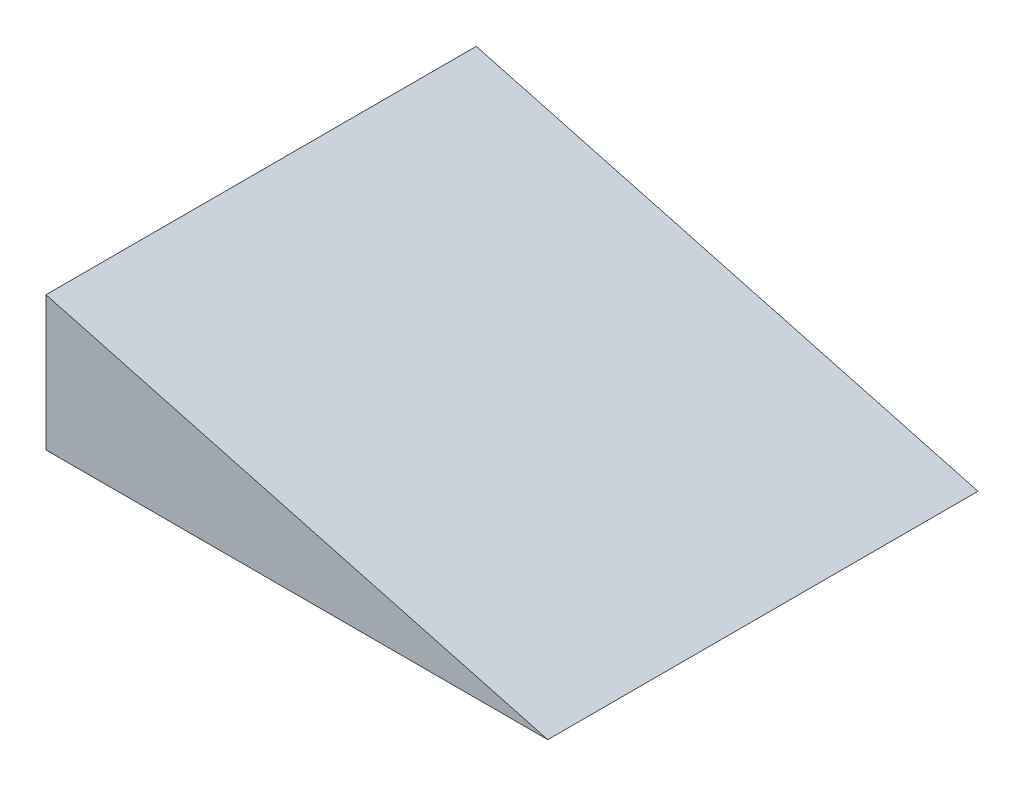
ISO-10303-21;
HEADER;
FILE_DESCRIPTION(('STEP AP214'),'2;1');
FILE_NAME('part.step','',(''),(''),'','','');
FILE_SCHEMA(('AUTOMOTIVE_DESIGN { 1 0 10303 214 1 1 1 1 }'));
ENDSEC;
DATA;
#1=APPLICATION_CONTEXT('core data for automotive mechanical design processes');
#2=APPLICATION_PROTOCOL_DEFINITION('international standard','automotive_design',2000,#1);
#3=PRODUCT_CONTEXT('',#1,'mechanical');
#4=PRODUCT('Part','Part','',(#3));
#5=PRODUCT_RELATED_PRODUCT_CATEGORY('part','',(#4));
#6=PRODUCT_DEFINITION_FORMATION('','',#4);
#7=PRODUCT_DEFINITION_CONTEXT('part definition',#1,'design');
#8=PRODUCT_DEFINITION('design','',#6,#7);
#9=PRODUCT_DEFINITION_SHAPE('','',#8);
#10=(LENGTH_UNIT() NAMED_UNIT(*) SI_UNIT(.MILLI.,.METRE.));
#11=(NAMED_UNIT(*) PLANE_ANGLE_UNIT() SI_UNIT($,.RADIAN.));
#12=(NAMED_UNIT(*) SI_UNIT($,.STERADIAN.) SOLID_ANGLE_UNIT());
#13=UNCERTAINTY_MEASURE_WITH_UNIT(LENGTH_MEASURE(1.E-05),#10,'distance_accuracy_value','');
#14=(GEOMETRIC_REPRESENTATION_CONTEXT(3) GLOBAL_UNCERTAINTY_ASSIGNED_CONTEXT((#13)) GLOBAL_UNIT_ASSIGNED_CONTEXT((#10,
#11,#12)) REPRESENTATION_CONTEXT('',''));
#15=CARTESIAN_POINT('',(0.,0.,0.));
#16=DIRECTION('',(0.,0.,1.));
#17=DIRECTION('',(1.,0.,0.));
#18=AXIS2_PLACEMENT_3D('',#15,#16,#17);
#19=CARTESIAN_POINT('',(473.97045256126,0.,-406.4));
#20=DIRECTION('',(0.,-1.,0.));
#21=DIRECTION('',(1.,0.,0.));
#22=AXIS2_PLACEMENT_3D('',#19,#20,#21);
#23=PLANE('',#22);
#24=DIRECTION('',(1.,0.,0.));
#25=VECTOR('',#24,1.);
#26=CARTESIAN_POINT('',(473.97045256126,0.,0.));
#27=LINE('',#26,#25);
#28=CARTESIAN_POINT('',(0.,0.,0.));
#29=VERTEX_POINT('',#28);
#30=CARTESIAN_POINT('',(473.97045256126,0.,0.));
#31=VERTEX_POINT('',#30);
#32=EDGE_CURVE('E85',#29,#31,#27,.T.);
#33=ORIENTED_EDGE('',*,*,#32,.F.);
#34=DIRECTION('',(0.,0.,1.));
#35=VECTOR('',#34,1.);
#36=CARTESIAN_POINT('',(0.,0.,-406.4));
#37=LINE('',#36,#35);
#38=CARTESIAN_POINT('',(0.,0.,-406.4));
#39=VERTEX_POINT('',#38);
#40=EDGE_CURVE('E11',#39,#29,#37,.T.);
#41=ORIENTED_EDGE('',*,*,#40,.F.);
#42=DIRECTION('',(1.,0.,0.));
#43=VECTOR('',#42,1.);
#44=CARTESIAN_POINT('',(473.97045256126,0.,-406.4));
#45=LINE('',#44,#43);
#46=CARTESIAN_POINT('',(473.97045256126,0.,-406.4));
#47=VERTEX_POINT('',#46);
#48=EDGE_CURVE('E77',#39,#47,#45,.T.);
#49=ORIENTED_EDGE('',*,*,#48,.T.);
#50=DIRECTION('',(0.,0.,1.));
#51=VECTOR('',#50,1.);
#52=CARTESIAN_POINT('',(473.97045256126,0.,-406.4));
#53=LINE('',#52,#51);
#54=EDGE_CURVE('E36',#47,#31,#53,.T.);
#55=ORIENTED_EDGE('',*,*,#54,.T.);
#56=EDGE_LOOP('',(#33,#41,#49,#55));
#57=FACE_BOUND('',#56,.T.);
#58=ADVANCED_FACE('F33',(#57),#23,.T.);
#59=CARTESIAN_POINT('',(0.,0.,-406.4));
#60=DIRECTION('',(-1.,0.,0.));
#61=DIRECTION('',(0.,0.,1.));
#62=AXIS2_PLACEMENT_3D('',#59,#60,#61);
#63=PLANE('',#62);
#64=DIRECTION('',(0.,-1.,0.));
#65=VECTOR('',#64,1.);
#66=CARTESIAN_POINT('',(0.,0.,0.));
#67=LINE('',#66,#65);
#68=CARTESIAN_POINT('',(0.,127.,0.));
#69=VERTEX_POINT('',#68);
#70=EDGE_CURVE('E79',#69,#29,#67,.T.);
#71=ORIENTED_EDGE('',*,*,#70,.F.);
#72=DIRECTION('',(0.,0.,1.));
#73=VECTOR('',#72,1.);
#74=CARTESIAN_POINT('',(0.,127.,-406.4));
#75=LINE('',#74,#73);
#76=CARTESIAN_POINT('',(0.,127.,-406.4));
#77=VERTEX_POINT('',#76);
#78=EDGE_CURVE('E42',#77,#69,#75,.T.);
#79=ORIENTED_EDGE('',*,*,#78,.F.);
#80=DIRECTION('',(0.,-1.,0.));
#81=VECTOR('',#80,1.);
#82=CARTESIAN_POINT('',(0.,0.,-406.4));
#83=LINE('',#82,#81);
#84=EDGE_CURVE('E74',#77,#39,#83,.T.);
#85=ORIENTED_EDGE('',*,*,#84,.T.);
#86=ORIENTED_EDGE('',*,*,#40,.T.);
#87=EDGE_LOOP('',(#71,#79,#85,#86));
#88=FACE_BOUND('',#87,.T.);
#89=ADVANCED_FACE('F89',(#88),#63,.T.);
#90=CARTESIAN_POINT('',(0.,127.,-406.4));
#91=DIRECTION('',(0.258819045102514,0.96592582628907,0.));
#92=DIRECTION('',(-0.96592582628907,0.258819045102514,0.));
#93=AXIS2_PLACEMENT_3D('',#90,#91,#92);
#94=PLANE('',#93);
#95=DIRECTION('',(-0.96592582628907,0.258819045102514,0.));
#96=VECTOR('',#95,1.);
#97=CARTESIAN_POINT('',(0.,127.,0.));
#98=LINE('',#97,#96);
#99=EDGE_CURVE('E72',#31,#69,#98,.T.);
#100=ORIENTED_EDGE('',*,*,#99,.F.);
#101=ORIENTED_EDGE('',*,*,#54,.F.);
#102=DIRECTION('',(-0.96592582628907,0.258819045102514,0.));
#103=VECTOR('',#102,1.);
#104=CARTESIAN_POINT('',(0.,127.,-406.4));
#105=LINE('',#104,#103);
#106=EDGE_CURVE('E70',#47,#77,#105,.T.);
#107=ORIENTED_EDGE('',*,*,#106,.T.);
#108=ORIENTED_EDGE('',*,*,#78,.T.);
#109=EDGE_LOOP('',(#100,#101,#107,#108));
#110=FACE_BOUND('',#109,.T.);
#111=ADVANCED_FACE('F69',(#110),#94,.T.);
#112=CARTESIAN_POINT('',(0.,0.,-406.4));
#113=DIRECTION('',(0.,0.,-1.));
#114=DIRECTION('',(-1.,0.,0.));
#115=AXIS2_PLACEMENT_3D('',#112,#113,#114);
#116=PLANE('',#115);
#117=ORIENTED_EDGE('',*,*,#48,.F.);
#118=ORIENTED_EDGE('',*,*,#84,.F.);
#119=ORIENTED_EDGE('',*,*,#106,.F.);
#120=EDGE_LOOP('',(#117,#118,#119));
#121=FACE_BOUND('',#120,.T.);
#122=ADVANCED_FACE('F76',(#121),#116,.T.);
#123=CARTESIAN_POINT('',(0.,0.,0.));
#124=DIRECTION('',(0.,0.,-1.));
#125=DIRECTION('',(-1.,0.,0.));
#126=AXIS2_PLACEMENT_3D('',#123,#124,#125);
#127=PLANE('',#126);
#128=ORIENTED_EDGE('',*,*,#32,.T.);
#129=ORIENTED_EDGE('',*,*,#99,.T.);
#130=ORIENTED_EDGE('',*,*,#70,.T.);
#131=EDGE_LOOP('',(#128,#129,#130));
#132=FACE_BOUND('',#131,.T.);
#133=ADVANCED_FACE('F88',(#132),#127,.F.);
#134=CLOSED_SHELL('',(#58,#89,#111,#122,#133));
#135=MANIFOLD_SOLID_BREP('B2',#134);
#136=ADVANCED_BREP_SHAPE_REPRESENTATION('',(#18,#135),#14);
#137=SHAPE_DEFINITION_REPRESENTATION(#9,#136);
ENDSEC;
END-ISO-10303-21;
